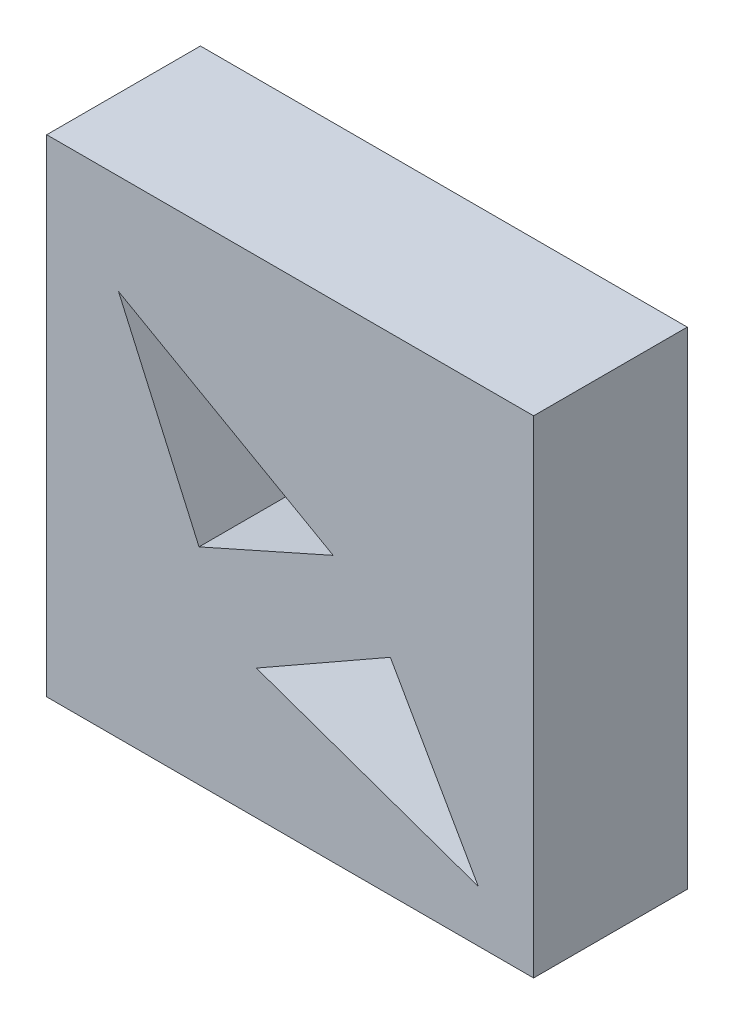
ISO-10303-21;
HEADER;
FILE_DESCRIPTION(('STEP AP214'),'2;1');
FILE_NAME('part.step','',(''),(''),'','','');
FILE_SCHEMA(('AUTOMOTIVE_DESIGN { 1 0 10303 214 1 1 1 1 }'));
ENDSEC;
DATA;
#1=APPLICATION_CONTEXT('core data for automotive mechanical design processes');
#2=APPLICATION_PROTOCOL_DEFINITION('international standard','automotive_design',2000,#1);
#3=PRODUCT_CONTEXT('',#1,'mechanical');
#4=PRODUCT('Part','Part','',(#3));
#5=PRODUCT_RELATED_PRODUCT_CATEGORY('part','',(#4));
#6=PRODUCT_DEFINITION_FORMATION('','',#4);
#7=PRODUCT_DEFINITION_CONTEXT('part definition',#1,'design');
#8=PRODUCT_DEFINITION('design','',#6,#7);
#9=PRODUCT_DEFINITION_SHAPE('','',#8);
#10=(LENGTH_UNIT() NAMED_UNIT(*) SI_UNIT(.MILLI.,.METRE.));
#11=(NAMED_UNIT(*) PLANE_ANGLE_UNIT() SI_UNIT($,.RADIAN.));
#12=(NAMED_UNIT(*) SI_UNIT($,.STERADIAN.) SOLID_ANGLE_UNIT());
#13=UNCERTAINTY_MEASURE_WITH_UNIT(LENGTH_MEASURE(1.E-05),#10,'distance_accuracy_value','');
#14=(GEOMETRIC_REPRESENTATION_CONTEXT(3) GLOBAL_UNCERTAINTY_ASSIGNED_CONTEXT((#13)) GLOBAL_UNIT_ASSIGNED_CONTEXT((#10,
#11,#12)) REPRESENTATION_CONTEXT('',''));
#15=CARTESIAN_POINT('',(0.,0.,0.));
#16=DIRECTION('',(0.,0.,1.));
#17=DIRECTION('',(1.,0.,0.));
#18=AXIS2_PLACEMENT_3D('',#15,#16,#17);
#19=CARTESIAN_POINT('',(0.,0.,25.25));
#20=DIRECTION('',(1.,0.,0.));
#21=DIRECTION('',(0.,0.,-1.));
#22=AXIS2_PLACEMENT_3D('',#19,#20,#21);
#23=PLANE('',#22);
#24=DIRECTION('',(0.,-1.,0.));
#25=VECTOR('',#24,1.);
#26=CARTESIAN_POINT('',(0.,0.,0.));
#27=LINE('',#26,#25);
#28=CARTESIAN_POINT('',(0.,80.,0.));
#29=VERTEX_POINT('',#28);
#30=CARTESIAN_POINT('',(0.,0.,0.));
#31=VERTEX_POINT('',#30);
#32=EDGE_CURVE('E156',#29,#31,#27,.T.);
#33=ORIENTED_EDGE('',*,*,#32,.T.);
#34=DIRECTION('',(0.,0.,-1.));
#35=VECTOR('',#34,1.);
#36=CARTESIAN_POINT('',(0.,0.,25.25));
#37=LINE('',#36,#35);
#38=CARTESIAN_POINT('',(0.,0.,25.25));
#39=VERTEX_POINT('',#38);
#40=EDGE_CURVE('E11',#39,#31,#37,.T.);
#41=ORIENTED_EDGE('',*,*,#40,.F.);
#42=DIRECTION('',(0.,-1.,0.));
#43=VECTOR('',#42,1.);
#44=CARTESIAN_POINT('',(0.,0.,25.25));
#45=LINE('',#44,#43);
#46=CARTESIAN_POINT('',(0.,80.,25.25));
#47=VERTEX_POINT('',#46);
#48=EDGE_CURVE('E161',#47,#39,#45,.T.);
#49=ORIENTED_EDGE('',*,*,#48,.F.);
#50=DIRECTION('',(0.,0.,-1.));
#51=VECTOR('',#50,1.);
#52=CARTESIAN_POINT('',(0.,80.,25.25));
#53=LINE('',#52,#51);
#54=EDGE_CURVE('E171',#47,#29,#53,.T.);
#55=ORIENTED_EDGE('',*,*,#54,.T.);
#56=EDGE_LOOP('',(#33,#41,#49,#55));
#57=FACE_BOUND('',#56,.T.);
#58=ADVANCED_FACE('F33',(#57),#23,.F.);
#59=CARTESIAN_POINT('',(0.,0.,25.25));
#60=DIRECTION('',(0.,1.,0.));
#61=DIRECTION('',(0.,0.,1.));
#62=AXIS2_PLACEMENT_3D('',#59,#60,#61);
#63=PLANE('',#62);
#64=DIRECTION('',(1.,0.,0.));
#65=VECTOR('',#64,1.);
#66=CARTESIAN_POINT('',(0.,0.,0.));
#67=LINE('',#66,#65);
#68=CARTESIAN_POINT('',(80.,0.,0.));
#69=VERTEX_POINT('',#68);
#70=EDGE_CURVE('E174',#31,#69,#67,.T.);
#71=ORIENTED_EDGE('',*,*,#70,.T.);
#72=DIRECTION('',(0.,0.,-1.));
#73=VECTOR('',#72,1.);
#74=CARTESIAN_POINT('',(80.,0.,25.25));
#75=LINE('',#74,#73);
#76=CARTESIAN_POINT('',(80.,0.,25.25));
#77=VERTEX_POINT('',#76);
#78=EDGE_CURVE('E40',#77,#69,#75,.T.);
#79=ORIENTED_EDGE('',*,*,#78,.F.);
#80=DIRECTION('',(1.,0.,0.));
#81=VECTOR('',#80,1.);
#82=CARTESIAN_POINT('',(0.,0.,25.25));
#83=LINE('',#82,#81);
#84=EDGE_CURVE('E164',#39,#77,#83,.T.);
#85=ORIENTED_EDGE('',*,*,#84,.F.);
#86=ORIENTED_EDGE('',*,*,#40,.T.);
#87=EDGE_LOOP('',(#71,#79,#85,#86));
#88=FACE_BOUND('',#87,.T.);
#89=ADVANCED_FACE('F203',(#88),#63,.F.);
#90=CARTESIAN_POINT('',(80.,0.,25.25));
#91=DIRECTION('',(-1.,0.,0.));
#92=DIRECTION('',(0.,0.,1.));
#93=AXIS2_PLACEMENT_3D('',#90,#91,#92);
#94=PLANE('',#93);
#95=DIRECTION('',(0.,1.,0.));
#96=VECTOR('',#95,1.);
#97=CARTESIAN_POINT('',(80.,0.,0.));
#98=LINE('',#97,#96);
#99=CARTESIAN_POINT('',(80.,80.,0.));
#100=VERTEX_POINT('',#99);
#101=EDGE_CURVE('E176',#69,#100,#98,.T.);
#102=ORIENTED_EDGE('',*,*,#101,.T.);
#103=DIRECTION('',(0.,0.,-1.));
#104=VECTOR('',#103,1.);
#105=CARTESIAN_POINT('',(80.,80.,25.25));
#106=LINE('',#105,#104);
#107=CARTESIAN_POINT('',(80.,80.,25.25));
#108=VERTEX_POINT('',#107);
#109=EDGE_CURVE('E181',#108,#100,#106,.T.);
#110=ORIENTED_EDGE('',*,*,#109,.F.);
#111=DIRECTION('',(0.,1.,0.));
#112=VECTOR('',#111,1.);
#113=CARTESIAN_POINT('',(80.,0.,25.25));
#114=LINE('',#113,#112);
#115=EDGE_CURVE('E167',#77,#108,#114,.T.);
#116=ORIENTED_EDGE('',*,*,#115,.F.);
#117=ORIENTED_EDGE('',*,*,#78,.T.);
#118=EDGE_LOOP('',(#102,#110,#116,#117));
#119=FACE_BOUND('',#118,.T.);
#120=ADVANCED_FACE('F188',(#119),#94,.F.);
#121=CARTESIAN_POINT('',(0.,80.,25.25));
#122=DIRECTION('',(0.,-1.,0.));
#123=DIRECTION('',(0.,0.,-1.));
#124=AXIS2_PLACEMENT_3D('',#121,#122,#123);
#125=PLANE('',#124);
#126=DIRECTION('',(-1.,0.,0.));
#127=VECTOR('',#126,1.);
#128=CARTESIAN_POINT('',(0.,80.,0.));
#129=LINE('',#128,#127);
#130=EDGE_CURVE('E165',#100,#29,#129,.T.);
#131=ORIENTED_EDGE('',*,*,#130,.T.);
#132=ORIENTED_EDGE('',*,*,#54,.F.);
#133=DIRECTION('',(-1.,0.,0.));
#134=VECTOR('',#133,1.);
#135=CARTESIAN_POINT('',(0.,80.,25.25));
#136=LINE('',#135,#134);
#137=EDGE_CURVE('E169',#108,#47,#136,.T.);
#138=ORIENTED_EDGE('',*,*,#137,.F.);
#139=ORIENTED_EDGE('',*,*,#109,.T.);
#140=EDGE_LOOP('',(#131,#132,#138,#139));
#141=FACE_BOUND('',#140,.T.);
#142=ADVANCED_FACE('F196',(#141),#125,.F.);
#143=CARTESIAN_POINT('',(0.,0.,25.25));
#144=DIRECTION('',(0.,0.,-1.));
#145=DIRECTION('',(-1.,0.,0.));
#146=AXIS2_PLACEMENT_3D('',#143,#144,#145);
#147=PLANE('',#146);
#148=DIRECTION('',(-0.494879730325076,0.868961479303531,0.));
#149=VECTOR('',#148,1.);
#150=CARTESIAN_POINT('',(56.4604224863672,33.8645323015072,25.25));
#151=LINE('',#150,#149);
#152=CARTESIAN_POINT('',(70.9179409349553,8.47851253082307,25.25));
#153=VERTEX_POINT('',#152);
#154=CARTESIAN_POINT('',(56.4604224863672,33.8645323015072,25.25));
#155=VERTEX_POINT('',#154);
#156=EDGE_CURVE('E127',#153,#155,#151,.T.);
#157=ORIENTED_EDGE('',*,*,#156,.F.);
#158=DIRECTION('',(0.943197174004598,-0.332233488603632,0.));
#159=VECTOR('',#158,1.);
#160=CARTESIAN_POINT('',(70.9179409349553,8.47851253082307,25.25));
#161=LINE('',#160,#159);
#162=CARTESIAN_POINT('',(34.4441480034339,21.3261077126411,25.25));
#163=VERTEX_POINT('',#162);
#164=EDGE_CURVE('E47',#163,#153,#161,.T.);
#165=ORIENTED_EDGE('',*,*,#164,.F.);
#166=DIRECTION('',(-0.868961479303531,-0.494879730325076,0.));
#167=VECTOR('',#166,1.);
#168=CARTESIAN_POINT('',(34.4441480034339,21.3261077126411,25.25));
#169=LINE('',#168,#167);
#170=EDGE_CURVE('E124',#155,#163,#169,.T.);
#171=ORIENTED_EDGE('',*,*,#170,.F.);
#172=EDGE_LOOP('',(#157,#165,#171));
#173=FACE_BOUND('',#172,.T.);
#174=DIRECTION('',(0.406664571169191,-0.913577542716423,0.));
#175=VECTOR('',#174,1.);
#176=CARTESIAN_POINT('',(11.7879443121467,63.6058374203117,25.25));
#177=LINE('',#176,#175);
#178=CARTESIAN_POINT('',(11.7879443121467,63.6058374203117,25.25));
#179=VERTEX_POINT('',#178);
#180=CARTESIAN_POINT('',(25.0268151541206,33.8645323015072,25.25));
#181=VERTEX_POINT('',#180);
#182=EDGE_CURVE('E149',#179,#181,#177,.T.);
#183=ORIENTED_EDGE('',*,*,#182,.F.);
#184=DIRECTION('',(-0.870690904035426,0.491830610708577,0.));
#185=VECTOR('',#184,1.);
#186=CARTESIAN_POINT('',(47.0692241537771,43.6763614941646,25.25));
#187=LINE('',#186,#185);
#188=CARTESIAN_POINT('',(47.0692241537771,43.6763614941646,25.25));
#189=VERTEX_POINT('',#188);
#190=EDGE_CURVE('E135',#189,#179,#187,.T.);
#191=ORIENTED_EDGE('',*,*,#190,.F.);
#192=DIRECTION('',(0.913577542716423,0.40666457116919,0.));
#193=VECTOR('',#192,1.);
#194=CARTESIAN_POINT('',(25.0268151541206,33.8645323015072,25.25));
#195=LINE('',#194,#193);
#196=EDGE_CURVE('E141',#181,#189,#195,.T.);
#197=ORIENTED_EDGE('',*,*,#196,.F.);
#198=EDGE_LOOP('',(#183,#191,#197));
#199=FACE_BOUND('',#198,.T.);
#200=ORIENTED_EDGE('',*,*,#48,.T.);
#201=ORIENTED_EDGE('',*,*,#84,.T.);
#202=ORIENTED_EDGE('',*,*,#115,.T.);
#203=ORIENTED_EDGE('',*,*,#137,.T.);
#204=EDGE_LOOP('',(#200,#201,#202,#203));
#205=FACE_BOUND('',#204,.T.);
#206=ADVANCED_FACE('F202',(#173,#199,#205),#147,.F.);
#207=CARTESIAN_POINT('',(0.,0.,0.));
#208=DIRECTION('',(0.,0.,-1.));
#209=DIRECTION('',(-1.,0.,0.));
#210=AXIS2_PLACEMENT_3D('',#207,#208,#209);
#211=PLANE('',#210);
#212=DIRECTION('',(0.943197174004598,-0.332233488603632,0.));
#213=VECTOR('',#212,1.);
#214=CARTESIAN_POINT('',(70.9179409349553,8.47851253082307,0.));
#215=LINE('',#214,#213);
#216=CARTESIAN_POINT('',(34.4441480034339,21.3261077126411,0.));
#217=VERTEX_POINT('',#216);
#218=CARTESIAN_POINT('',(70.9179409349553,8.47851253082307,0.));
#219=VERTEX_POINT('',#218);
#220=EDGE_CURVE('E111',#217,#219,#215,.T.);
#221=ORIENTED_EDGE('',*,*,#220,.T.);
#222=DIRECTION('',(-0.494879730325076,0.868961479303531,0.));
#223=VECTOR('',#222,1.);
#224=CARTESIAN_POINT('',(56.4604224863672,33.8645323015072,0.));
#225=LINE('',#224,#223);
#226=CARTESIAN_POINT('',(56.4604224863672,33.8645323015072,0.));
#227=VERTEX_POINT('',#226);
#228=EDGE_CURVE('E118',#219,#227,#225,.T.);
#229=ORIENTED_EDGE('',*,*,#228,.T.);
#230=DIRECTION('',(-0.868961479303531,-0.494879730325076,0.));
#231=VECTOR('',#230,1.);
#232=CARTESIAN_POINT('',(34.4441480034339,21.3261077126411,0.));
#233=LINE('',#232,#231);
#234=EDGE_CURVE('E55',#227,#217,#233,.T.);
#235=ORIENTED_EDGE('',*,*,#234,.T.);
#236=EDGE_LOOP('',(#221,#229,#235));
#237=FACE_BOUND('',#236,.T.);
#238=DIRECTION('',(-0.870690904035426,0.491830610708577,0.));
#239=VECTOR('',#238,1.);
#240=CARTESIAN_POINT('',(47.0692241537771,43.6763614941646,0.));
#241=LINE('',#240,#239);
#242=CARTESIAN_POINT('',(47.0692241537771,43.6763614941646,0.));
#243=VERTEX_POINT('',#242);
#244=CARTESIAN_POINT('',(11.7879443121467,63.6058374203117,0.));
#245=VERTEX_POINT('',#244);
#246=EDGE_CURVE('E137',#243,#245,#241,.T.);
#247=ORIENTED_EDGE('',*,*,#246,.T.);
#248=DIRECTION('',(0.406664571169191,-0.913577542716423,0.));
#249=VECTOR('',#248,1.);
#250=CARTESIAN_POINT('',(11.7879443121467,63.6058374203117,0.));
#251=LINE('',#250,#249);
#252=CARTESIAN_POINT('',(25.0268151541206,33.8645323015072,0.));
#253=VERTEX_POINT('',#252);
#254=EDGE_CURVE('E140',#245,#253,#251,.T.);
#255=ORIENTED_EDGE('',*,*,#254,.T.);
#256=DIRECTION('',(0.913577542716423,0.40666457116919,0.));
#257=VECTOR('',#256,1.);
#258=CARTESIAN_POINT('',(25.0268151541206,33.8645323015072,0.));
#259=LINE('',#258,#257);
#260=EDGE_CURVE('E144',#253,#243,#259,.T.);
#261=ORIENTED_EDGE('',*,*,#260,.T.);
#262=EDGE_LOOP('',(#247,#255,#261));
#263=FACE_BOUND('',#262,.T.);
#264=ORIENTED_EDGE('',*,*,#32,.F.);
#265=ORIENTED_EDGE('',*,*,#130,.F.);
#266=ORIENTED_EDGE('',*,*,#101,.F.);
#267=ORIENTED_EDGE('',*,*,#70,.F.);
#268=EDGE_LOOP('',(#264,#265,#266,#267));
#269=FACE_BOUND('',#268,.T.);
#270=ADVANCED_FACE('F122',(#237,#263,#269),#211,.T.);
#271=CARTESIAN_POINT('',(47.0692241537771,43.6763614941646,0.));
#272=DIRECTION('',(0.491830610708577,0.870690904035426,0.));
#273=DIRECTION('',(-0.870690904035426,0.491830610708577,0.));
#274=AXIS2_PLACEMENT_3D('',#271,#272,#273);
#275=PLANE('',#274);
#276=ORIENTED_EDGE('',*,*,#190,.T.);
#277=DIRECTION('',(0.,0.,1.));
#278=VECTOR('',#277,1.);
#279=CARTESIAN_POINT('',(11.7879443121467,63.6058374203117,0.));
#280=LINE('',#279,#278);
#281=EDGE_CURVE('E147',#245,#179,#280,.T.);
#282=ORIENTED_EDGE('',*,*,#281,.F.);
#283=ORIENTED_EDGE('',*,*,#246,.F.);
#284=DIRECTION('',(0.,0.,1.));
#285=VECTOR('',#284,1.);
#286=CARTESIAN_POINT('',(47.0692241537771,43.6763614941646,0.));
#287=LINE('',#286,#285);
#288=EDGE_CURVE('E154',#243,#189,#287,.T.);
#289=ORIENTED_EDGE('',*,*,#288,.T.);
#290=EDGE_LOOP('',(#276,#282,#283,#289));
#291=FACE_BOUND('',#290,.T.);
#292=ADVANCED_FACE('F215',(#291),#275,.F.);
#293=CARTESIAN_POINT('',(25.0268151541206,33.8645323015072,0.));
#294=DIRECTION('',(0.40666457116919,-0.913577542716423,0.));
#295=DIRECTION('',(0.913577542716423,0.40666457116919,0.));
#296=AXIS2_PLACEMENT_3D('',#293,#294,#295);
#297=PLANE('',#296);
#298=ORIENTED_EDGE('',*,*,#196,.T.);
#299=ORIENTED_EDGE('',*,*,#288,.F.);
#300=ORIENTED_EDGE('',*,*,#260,.F.);
#301=DIRECTION('',(0.,0.,1.));
#302=VECTOR('',#301,1.);
#303=CARTESIAN_POINT('',(25.0268151541206,33.8645323015072,0.));
#304=LINE('',#303,#302);
#305=EDGE_CURVE('E157',#253,#181,#304,.T.);
#306=ORIENTED_EDGE('',*,*,#305,.T.);
#307=EDGE_LOOP('',(#298,#299,#300,#306));
#308=FACE_BOUND('',#307,.T.);
#309=ADVANCED_FACE('F221',(#308),#297,.F.);
#310=CARTESIAN_POINT('',(11.7879443121467,63.6058374203117,0.));
#311=DIRECTION('',(-0.913577542716423,-0.406664571169191,0.));
#312=DIRECTION('',(0.406664571169191,-0.913577542716423,0.));
#313=AXIS2_PLACEMENT_3D('',#310,#311,#312);
#314=PLANE('',#313);
#315=ORIENTED_EDGE('',*,*,#182,.T.);
#316=ORIENTED_EDGE('',*,*,#305,.F.);
#317=ORIENTED_EDGE('',*,*,#254,.F.);
#318=ORIENTED_EDGE('',*,*,#281,.T.);
#319=EDGE_LOOP('',(#315,#316,#317,#318));
#320=FACE_BOUND('',#319,.T.);
#321=ADVANCED_FACE('F223',(#320),#314,.F.);
#322=CARTESIAN_POINT('',(70.9179409349553,8.47851253082307,0.));
#323=DIRECTION('',(-0.332233488603632,-0.943197174004598,0.));
#324=DIRECTION('',(0.943197174004598,-0.332233488603632,0.));
#325=AXIS2_PLACEMENT_3D('',#322,#323,#324);
#326=PLANE('',#325);
#327=ORIENTED_EDGE('',*,*,#164,.T.);
#328=DIRECTION('',(0.,0.,1.));
#329=VECTOR('',#328,1.);
#330=CARTESIAN_POINT('',(70.9179409349553,8.47851253082307,0.));
#331=LINE('',#330,#329);
#332=EDGE_CURVE('E107',#219,#153,#331,.T.);
#333=ORIENTED_EDGE('',*,*,#332,.F.);
#334=ORIENTED_EDGE('',*,*,#220,.F.);
#335=DIRECTION('',(0.,0.,1.));
#336=VECTOR('',#335,1.);
#337=CARTESIAN_POINT('',(34.4441480034339,21.3261077126411,0.));
#338=LINE('',#337,#336);
#339=EDGE_CURVE('E133',#217,#163,#338,.T.);
#340=ORIENTED_EDGE('',*,*,#339,.T.);
#341=EDGE_LOOP('',(#327,#333,#334,#340));
#342=FACE_BOUND('',#341,.T.);
#343=ADVANCED_FACE('F109',(#342),#326,.F.);
#344=CARTESIAN_POINT('',(34.4441480034339,21.3261077126411,0.));
#345=DIRECTION('',(-0.494879730325076,0.868961479303531,0.));
#346=DIRECTION('',(-0.868961479303531,-0.494879730325076,0.));
#347=AXIS2_PLACEMENT_3D('',#344,#345,#346);
#348=PLANE('',#347);
#349=ORIENTED_EDGE('',*,*,#170,.T.);
#350=ORIENTED_EDGE('',*,*,#339,.F.);
#351=ORIENTED_EDGE('',*,*,#234,.F.);
#352=DIRECTION('',(0.,0.,1.));
#353=VECTOR('',#352,1.);
#354=CARTESIAN_POINT('',(56.4604224863672,33.8645323015072,0.));
#355=LINE('',#354,#353);
#356=EDGE_CURVE('E115',#227,#155,#355,.T.);
#357=ORIENTED_EDGE('',*,*,#356,.T.);
#358=EDGE_LOOP('',(#349,#350,#351,#357));
#359=FACE_BOUND('',#358,.T.);
#360=ADVANCED_FACE('F232',(#359),#348,.F.);
#361=CARTESIAN_POINT('',(56.4604224863672,33.8645323015072,0.));
#362=DIRECTION('',(0.868961479303531,0.494879730325076,0.));
#363=DIRECTION('',(-0.494879730325076,0.868961479303531,0.));
#364=AXIS2_PLACEMENT_3D('',#361,#362,#363);
#365=PLANE('',#364);
#366=ORIENTED_EDGE('',*,*,#156,.T.);
#367=ORIENTED_EDGE('',*,*,#356,.F.);
#368=ORIENTED_EDGE('',*,*,#228,.F.);
#369=ORIENTED_EDGE('',*,*,#332,.T.);
#370=EDGE_LOOP('',(#366,#367,#368,#369));
#371=FACE_BOUND('',#370,.T.);
#372=ADVANCED_FACE('F119',(#371),#365,.F.);
#373=CLOSED_SHELL('',(#58,#89,#120,#142,#206,#270,#292,#309,#321,#343,#360,#372));
#374=MANIFOLD_SOLID_BREP('B2',#373);
#375=ADVANCED_BREP_SHAPE_REPRESENTATION('',(#18,#374),#14);
#376=SHAPE_DEFINITION_REPRESENTATION(#9,#375);
ENDSEC;
END-ISO-10303-21;
